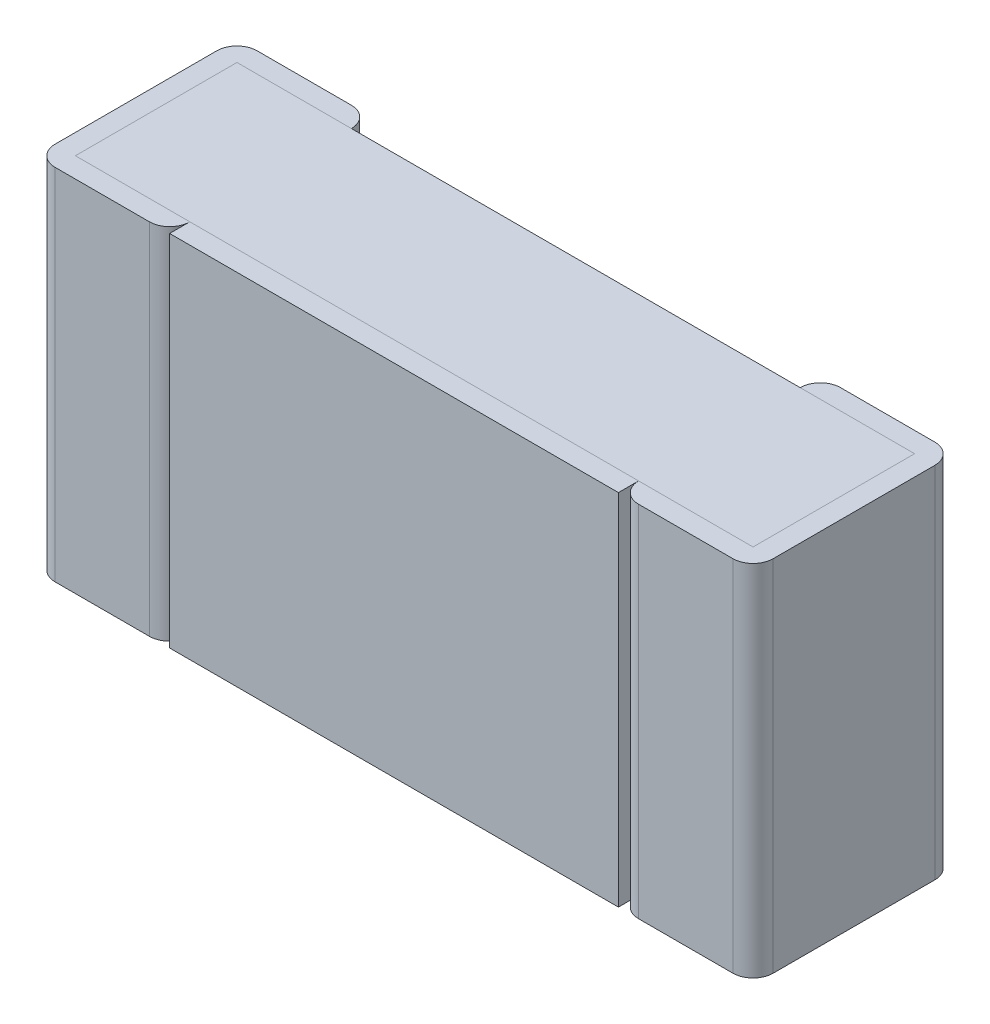
ISO-10303-21;
HEADER;
FILE_DESCRIPTION(('STEP AP214'),'2;1');
FILE_NAME('part.step','',(''),(''),'','','');
FILE_SCHEMA(('AUTOMOTIVE_DESIGN { 1 0 10303 214 1 1 1 1 }'));
ENDSEC;
DATA;
#1=APPLICATION_CONTEXT('core data for automotive mechanical design processes');
#2=APPLICATION_PROTOCOL_DEFINITION('international standard','automotive_design',2000,#1);
#3=PRODUCT_CONTEXT('',#1,'mechanical');
#4=PRODUCT('Part','Part','',(#3));
#5=PRODUCT_RELATED_PRODUCT_CATEGORY('part','',(#4));
#6=PRODUCT_DEFINITION_FORMATION('','',#4);
#7=PRODUCT_DEFINITION_CONTEXT('part definition',#1,'design');
#8=PRODUCT_DEFINITION('design','',#6,#7);
#9=PRODUCT_DEFINITION_SHAPE('','',#8);
#10=(LENGTH_UNIT() NAMED_UNIT(*) SI_UNIT(.MILLI.,.METRE.));
#11=(NAMED_UNIT(*) PLANE_ANGLE_UNIT() SI_UNIT($,.RADIAN.));
#12=(NAMED_UNIT(*) SI_UNIT($,.STERADIAN.) SOLID_ANGLE_UNIT());
#13=UNCERTAINTY_MEASURE_WITH_UNIT(LENGTH_MEASURE(1.E-05),#10,'distance_accuracy_value','');
#14=(GEOMETRIC_REPRESENTATION_CONTEXT(3) GLOBAL_UNCERTAINTY_ASSIGNED_CONTEXT((#13)) GLOBAL_UNIT_ASSIGNED_CONTEXT((#10,
#11,#12)) REPRESENTATION_CONTEXT('',''));
#15=CARTESIAN_POINT('',(0.,0.,0.));
#16=DIRECTION('',(0.,0.,1.));
#17=DIRECTION('',(1.,0.,0.));
#18=AXIS2_PLACEMENT_3D('',#15,#16,#17);
#19=CARTESIAN_POINT('',(-0.5,-0.4,0.45));
#20=DIRECTION('',(0.,0.,1.));
#21=DIRECTION('',(1.,0.,0.));
#22=AXIS2_PLACEMENT_3D('',#19,#20,#21);
#23=PLANE('',#22);
#24=DIRECTION('',(0.,1.,0.));
#25=VECTOR('',#24,1.);
#26=CARTESIAN_POINT('',(-0.5,-0.4,0.45));
#27=LINE('',#26,#25);
#28=CARTESIAN_POINT('',(-0.5,-0.4,0.45));
#29=VERTEX_POINT('',#28);
#30=CARTESIAN_POINT('',(-0.5,0.4,0.45));
#31=VERTEX_POINT('',#30);
#32=EDGE_CURVE('E411',#29,#31,#27,.T.);
#33=ORIENTED_EDGE('',*,*,#32,.F.);
#34=DIRECTION('',(1.,0.,0.));
#35=VECTOR('',#34,1.);
#36=CARTESIAN_POINT('',(-0.5,-0.4,0.45));
#37=LINE('',#36,#35);
#38=CARTESIAN_POINT('',(0.5,-0.4,0.45));
#39=VERTEX_POINT('',#38);
#40=EDGE_CURVE('E412',#29,#39,#37,.T.);
#41=ORIENTED_EDGE('',*,*,#40,.T.);
#42=DIRECTION('',(0.,1.,0.));
#43=VECTOR('',#42,1.);
#44=CARTESIAN_POINT('',(0.5,-0.4,0.45));
#45=LINE('',#44,#43);
#46=CARTESIAN_POINT('',(0.5,0.4,0.45));
#47=VERTEX_POINT('',#46);
#48=EDGE_CURVE('E11',#39,#47,#45,.T.);
#49=ORIENTED_EDGE('',*,*,#48,.T.);
#50=DIRECTION('',(1.,0.,0.));
#51=VECTOR('',#50,1.);
#52=CARTESIAN_POINT('',(-0.5,0.4,0.45));
#53=LINE('',#52,#51);
#54=EDGE_CURVE('E333',#31,#47,#53,.T.);
#55=ORIENTED_EDGE('',*,*,#54,.F.);
#56=EDGE_LOOP('',(#33,#41,#49,#55));
#57=FACE_BOUND('',#56,.T.);
#58=ADVANCED_FACE('F17',(#57),#23,.T.);
#59=CARTESIAN_POINT('',(0.5,-0.4,0.405));
#60=DIRECTION('',(1.,0.,0.));
#61=DIRECTION('',(0.,1.,0.));
#62=AXIS2_PLACEMENT_3D('',#59,#60,#61);
#63=PLANE('',#62);
#64=DIRECTION('',(0.,0.,1.));
#65=VECTOR('',#64,1.);
#66=CARTESIAN_POINT('',(0.5,-0.4,0.405));
#67=LINE('',#66,#65);
#68=CARTESIAN_POINT('',(0.5,-0.4,0.405));
#69=VERTEX_POINT('',#68);
#70=EDGE_CURVE('E418',#69,#39,#67,.T.);
#71=ORIENTED_EDGE('',*,*,#70,.F.);
#72=DIRECTION('',(0.,1.,0.));
#73=VECTOR('',#72,1.);
#74=CARTESIAN_POINT('',(0.5,-0.4,0.405));
#75=LINE('',#74,#73);
#76=CARTESIAN_POINT('',(0.5,0.4,0.405));
#77=VERTEX_POINT('',#76);
#78=EDGE_CURVE('E28',#69,#77,#75,.T.);
#79=ORIENTED_EDGE('',*,*,#78,.T.);
#80=DIRECTION('',(0.,0.,1.));
#81=VECTOR('',#80,1.);
#82=CARTESIAN_POINT('',(0.5,0.4,0.405));
#83=LINE('',#82,#81);
#84=EDGE_CURVE('E330',#77,#47,#83,.T.);
#85=ORIENTED_EDGE('',*,*,#84,.T.);
#86=ORIENTED_EDGE('',*,*,#48,.F.);
#87=EDGE_LOOP('',(#71,#79,#85,#86));
#88=FACE_BOUND('',#87,.T.);
#89=ADVANCED_FACE('F602',(#88),#63,.T.);
#90=CARTESIAN_POINT('',(0.545,-0.4,0.405));
#91=DIRECTION('',(0.,1.,0.));
#92=DIRECTION('',(-1.,0.,0.));
#93=AXIS2_PLACEMENT_3D('',#90,#91,#92);
#94=CYLINDRICAL_SURFACE('',#93,0.045);
#95=CARTESIAN_POINT('',(0.545,-0.4,0.405));
#96=DIRECTION('',(0.,1.,0.));
#97=DIRECTION('',(0.,0.,1.));
#98=AXIS2_PLACEMENT_3D('',#95,#96,#97);
#99=CIRCLE('',#98,0.045);
#100=CARTESIAN_POINT('',(0.545,-0.4,0.45));
#101=VERTEX_POINT('',#100);
#102=EDGE_CURVE('E322',#69,#101,#99,.T.);
#103=ORIENTED_EDGE('',*,*,#102,.T.);
#104=DIRECTION('',(0.,1.,0.));
#105=VECTOR('',#104,1.);
#106=CARTESIAN_POINT('',(0.545,-0.4,0.45));
#107=LINE('',#106,#105);
#108=CARTESIAN_POINT('',(0.545,0.4,0.45));
#109=VERTEX_POINT('',#108);
#110=EDGE_CURVE('E193',#101,#109,#107,.T.);
#111=ORIENTED_EDGE('',*,*,#110,.T.);
#112=CARTESIAN_POINT('',(0.545,0.4,0.405));
#113=DIRECTION('',(0.,1.,0.));
#114=DIRECTION('',(0.,0.,1.));
#115=AXIS2_PLACEMENT_3D('',#112,#113,#114);
#116=CIRCLE('',#115,0.045);
#117=EDGE_CURVE('E323',#77,#109,#116,.T.);
#118=ORIENTED_EDGE('',*,*,#117,.F.);
#119=ORIENTED_EDGE('',*,*,#78,.F.);
#120=EDGE_LOOP('',(#103,#111,#118,#119));
#121=FACE_BOUND('',#120,.T.);
#122=ADVANCED_FACE('F606',(#121),#94,.T.);
#123=CARTESIAN_POINT('',(0.5,-0.4,0.45));
#124=DIRECTION('',(0.,0.,1.));
#125=DIRECTION('',(1.,0.,0.));
#126=AXIS2_PLACEMENT_3D('',#123,#124,#125);
#127=PLANE('',#126);
#128=DIRECTION('',(1.,0.,0.));
#129=VECTOR('',#128,1.);
#130=CARTESIAN_POINT('',(0.5,0.4,0.45));
#131=LINE('',#130,#129);
#132=CARTESIAN_POINT('',(0.755,0.4,0.45));
#133=VERTEX_POINT('',#132);
#134=EDGE_CURVE('E327',#109,#133,#131,.T.);
#135=ORIENTED_EDGE('',*,*,#134,.F.);
#136=ORIENTED_EDGE('',*,*,#110,.F.);
#137=DIRECTION('',(1.,0.,0.));
#138=VECTOR('',#137,1.);
#139=CARTESIAN_POINT('',(0.5,-0.4,0.45));
#140=LINE('',#139,#138);
#141=CARTESIAN_POINT('',(0.755,-0.4,0.45));
#142=VERTEX_POINT('',#141);
#143=EDGE_CURVE('E363',#101,#142,#140,.T.);
#144=ORIENTED_EDGE('',*,*,#143,.T.);
#145=DIRECTION('',(0.,1.,0.));
#146=VECTOR('',#145,1.);
#147=CARTESIAN_POINT('',(0.755,-0.4,0.45));
#148=LINE('',#147,#146);
#149=EDGE_CURVE('E297',#142,#133,#148,.T.);
#150=ORIENTED_EDGE('',*,*,#149,.T.);
#151=EDGE_LOOP('',(#135,#136,#144,#150));
#152=FACE_BOUND('',#151,.T.);
#153=ADVANCED_FACE('F462',(#152),#127,.T.);
#154=CARTESIAN_POINT('',(0.755,-0.4,0.405));
#155=DIRECTION('',(0.,1.,0.));
#156=DIRECTION('',(1.,0.,0.));
#157=AXIS2_PLACEMENT_3D('',#154,#155,#156);
#158=CYLINDRICAL_SURFACE('',#157,0.045);
#159=DIRECTION('',(0.,1.,0.));
#160=VECTOR('',#159,1.);
#161=CARTESIAN_POINT('',(0.8,-0.4,0.405));
#162=LINE('',#161,#160);
#163=CARTESIAN_POINT('',(0.8,-0.4,0.405));
#164=VERTEX_POINT('',#163);
#165=CARTESIAN_POINT('',(0.8,0.4,0.405));
#166=VERTEX_POINT('',#165);
#167=EDGE_CURVE('E300',#164,#166,#162,.T.);
#168=ORIENTED_EDGE('',*,*,#167,.T.);
#169=CARTESIAN_POINT('',(0.755,0.4,0.405));
#170=DIRECTION('',(0.,-1.,0.));
#171=DIRECTION('',(0.,0.,1.));
#172=AXIS2_PLACEMENT_3D('',#169,#170,#171);
#173=CIRCLE('',#172,0.045);
#174=EDGE_CURVE('E276',#166,#133,#173,.T.);
#175=ORIENTED_EDGE('',*,*,#174,.T.);
#176=ORIENTED_EDGE('',*,*,#149,.F.);
#177=CARTESIAN_POINT('',(0.755,-0.4,0.405));
#178=DIRECTION('',(0.,-1.,0.));
#179=DIRECTION('',(0.,0.,1.));
#180=AXIS2_PLACEMENT_3D('',#177,#178,#179);
#181=CIRCLE('',#180,0.045);
#182=EDGE_CURVE('E442',#164,#142,#181,.T.);
#183=ORIENTED_EDGE('',*,*,#182,.F.);
#184=EDGE_LOOP('',(#168,#175,#176,#183));
#185=FACE_BOUND('',#184,.T.);
#186=ADVANCED_FACE('F467',(#185),#158,.T.);
#187=CARTESIAN_POINT('',(0.8,-0.4,0.));
#188=DIRECTION('',(1.,0.,0.));
#189=DIRECTION('',(0.,1.,0.));
#190=AXIS2_PLACEMENT_3D('',#187,#188,#189);
#191=PLANE('',#190);
#192=DIRECTION('',(0.,0.,1.));
#193=VECTOR('',#192,1.);
#194=CARTESIAN_POINT('',(0.8,-0.4,0.));
#195=LINE('',#194,#193);
#196=CARTESIAN_POINT('',(0.8,-0.4,0.045));
#197=VERTEX_POINT('',#196);
#198=EDGE_CURVE('E446',#197,#164,#195,.T.);
#199=ORIENTED_EDGE('',*,*,#198,.F.);
#200=DIRECTION('',(0.,1.,0.));
#201=VECTOR('',#200,1.);
#202=CARTESIAN_POINT('',(0.8,-0.4,0.045));
#203=LINE('',#202,#201);
#204=CARTESIAN_POINT('',(0.8,0.4,0.045));
#205=VERTEX_POINT('',#204);
#206=EDGE_CURVE('E303',#197,#205,#203,.T.);
#207=ORIENTED_EDGE('',*,*,#206,.T.);
#208=DIRECTION('',(0.,0.,1.));
#209=VECTOR('',#208,1.);
#210=CARTESIAN_POINT('',(0.8,0.4,0.));
#211=LINE('',#210,#209);
#212=EDGE_CURVE('E271',#205,#166,#211,.T.);
#213=ORIENTED_EDGE('',*,*,#212,.T.);
#214=ORIENTED_EDGE('',*,*,#167,.F.);
#215=EDGE_LOOP('',(#199,#207,#213,#214));
#216=FACE_BOUND('',#215,.T.);
#217=ADVANCED_FACE('F475',(#216),#191,.T.);
#218=CARTESIAN_POINT('',(0.755,-0.4,0.045));
#219=DIRECTION('',(0.,1.,0.));
#220=DIRECTION('',(1.,0.,0.));
#221=AXIS2_PLACEMENT_3D('',#218,#219,#220);
#222=CYLINDRICAL_SURFACE('',#221,0.045);
#223=CARTESIAN_POINT('',(0.755,-0.4,0.045));
#224=DIRECTION('',(0.,1.,0.));
#225=DIRECTION('',(0.,0.,1.));
#226=AXIS2_PLACEMENT_3D('',#223,#224,#225);
#227=CIRCLE('',#226,0.045);
#228=CARTESIAN_POINT('',(0.755,-0.4,0.));
#229=VERTEX_POINT('',#228);
#230=EDGE_CURVE('E406',#197,#229,#227,.T.);
#231=ORIENTED_EDGE('',*,*,#230,.T.);
#232=DIRECTION('',(0.,1.,0.));
#233=VECTOR('',#232,1.);
#234=CARTESIAN_POINT('',(0.755,-0.4,0.));
#235=LINE('',#234,#233);
#236=CARTESIAN_POINT('',(0.755,0.4,0.));
#237=VERTEX_POINT('',#236);
#238=EDGE_CURVE('E181',#229,#237,#235,.T.);
#239=ORIENTED_EDGE('',*,*,#238,.T.);
#240=CARTESIAN_POINT('',(0.755,0.4,0.045));
#241=DIRECTION('',(0.,1.,0.));
#242=DIRECTION('',(0.,0.,1.));
#243=AXIS2_PLACEMENT_3D('',#240,#241,#242);
#244=CIRCLE('',#243,0.045);
#245=EDGE_CURVE('E275',#205,#237,#244,.T.);
#246=ORIENTED_EDGE('',*,*,#245,.F.);
#247=ORIENTED_EDGE('',*,*,#206,.F.);
#248=EDGE_LOOP('',(#231,#239,#246,#247));
#249=FACE_BOUND('',#248,.T.);
#250=ADVANCED_FACE('F481',(#249),#222,.T.);
#251=CARTESIAN_POINT('',(0.5,-0.4,0.));
#252=DIRECTION('',(0.,0.,1.));
#253=DIRECTION('',(1.,0.,0.));
#254=AXIS2_PLACEMENT_3D('',#251,#252,#253);
#255=PLANE('',#254);
#256=ORIENTED_EDGE('',*,*,#238,.F.);
#257=DIRECTION('',(1.,0.,0.));
#258=VECTOR('',#257,1.);
#259=CARTESIAN_POINT('',(0.5,-0.4,0.));
#260=LINE('',#259,#258);
#261=CARTESIAN_POINT('',(0.545,-0.4,0.));
#262=VERTEX_POINT('',#261);
#263=EDGE_CURVE('E321',#262,#229,#260,.T.);
#264=ORIENTED_EDGE('',*,*,#263,.F.);
#265=DIRECTION('',(0.,1.,0.));
#266=VECTOR('',#265,1.);
#267=CARTESIAN_POINT('',(0.545,-0.4,0.));
#268=LINE('',#267,#266);
#269=CARTESIAN_POINT('',(0.545,0.4,0.));
#270=VERTEX_POINT('',#269);
#271=EDGE_CURVE('E172',#262,#270,#268,.T.);
#272=ORIENTED_EDGE('',*,*,#271,.T.);
#273=DIRECTION('',(1.,0.,0.));
#274=VECTOR('',#273,1.);
#275=CARTESIAN_POINT('',(0.5,0.4,0.));
#276=LINE('',#275,#274);
#277=EDGE_CURVE('E281',#270,#237,#276,.T.);
#278=ORIENTED_EDGE('',*,*,#277,.T.);
#279=EDGE_LOOP('',(#256,#264,#272,#278));
#280=FACE_BOUND('',#279,.T.);
#281=ADVANCED_FACE('F478',(#280),#255,.F.);
#282=CARTESIAN_POINT('',(0.545,-0.4,0.045));
#283=DIRECTION('',(0.,1.,0.));
#284=DIRECTION('',(-1.,0.,0.));
#285=AXIS2_PLACEMENT_3D('',#282,#283,#284);
#286=CYLINDRICAL_SURFACE('',#285,0.045);
#287=DIRECTION('',(0.,1.,0.));
#288=VECTOR('',#287,1.);
#289=CARTESIAN_POINT('',(0.5,-0.4,0.045));
#290=LINE('',#289,#288);
#291=CARTESIAN_POINT('',(0.5,-0.4,0.045));
#292=VERTEX_POINT('',#291);
#293=CARTESIAN_POINT('',(0.5,0.4,0.045));
#294=VERTEX_POINT('',#293);
#295=EDGE_CURVE('E353',#292,#294,#290,.T.);
#296=ORIENTED_EDGE('',*,*,#295,.T.);
#297=CARTESIAN_POINT('',(0.545,0.4,0.045));
#298=DIRECTION('',(0.,-1.,0.));
#299=DIRECTION('',(0.,0.,1.));
#300=AXIS2_PLACEMENT_3D('',#297,#298,#299);
#301=CIRCLE('',#300,0.045);
#302=EDGE_CURVE('E284',#294,#270,#301,.T.);
#303=ORIENTED_EDGE('',*,*,#302,.T.);
#304=ORIENTED_EDGE('',*,*,#271,.F.);
#305=CARTESIAN_POINT('',(0.545,-0.4,0.045));
#306=DIRECTION('',(0.,-1.,0.));
#307=DIRECTION('',(0.,0.,1.));
#308=AXIS2_PLACEMENT_3D('',#305,#306,#307);
#309=CIRCLE('',#308,0.045);
#310=EDGE_CURVE('E317',#292,#262,#309,.T.);
#311=ORIENTED_EDGE('',*,*,#310,.F.);
#312=EDGE_LOOP('',(#296,#303,#304,#311));
#313=FACE_BOUND('',#312,.T.);
#314=ADVANCED_FACE('F651',(#313),#286,.T.);
#315=CARTESIAN_POINT('',(-0.5,0.4,0.405));
#316=DIRECTION('',(0.,1.,0.));
#317=DIRECTION('',(1.,0.,0.));
#318=AXIS2_PLACEMENT_3D('',#315,#316,#317);
#319=PLANE('',#318);
#320=DIRECTION('',(1.,0.,0.));
#321=VECTOR('',#320,1.);
#322=CARTESIAN_POINT('',(-0.5,0.4,0.405));
#323=LINE('',#322,#321);
#324=CARTESIAN_POINT('',(-0.5,0.4,0.405));
#325=VERTEX_POINT('',#324);
#326=EDGE_CURVE('E296',#325,#77,#323,.T.);
#327=ORIENTED_EDGE('',*,*,#326,.F.);
#328=DIRECTION('',(0.,0.,1.));
#329=VECTOR('',#328,1.);
#330=CARTESIAN_POINT('',(-0.5,0.4,0.405));
#331=LINE('',#330,#329);
#332=EDGE_CURVE('E285',#325,#31,#331,.T.);
#333=ORIENTED_EDGE('',*,*,#332,.T.);
#334=ORIENTED_EDGE('',*,*,#54,.T.);
#335=ORIENTED_EDGE('',*,*,#84,.F.);
#336=EDGE_LOOP('',(#327,#333,#334,#335));
#337=FACE_BOUND('',#336,.T.);
#338=ADVANCED_FACE('F563',(#337),#319,.T.);
#339=CARTESIAN_POINT('',(0.5,0.4,0.));
#340=DIRECTION('',(0.,1.,0.));
#341=DIRECTION('',(1.,0.,0.));
#342=AXIS2_PLACEMENT_3D('',#339,#340,#341);
#343=PLANE('',#342);
#344=ORIENTED_EDGE('',*,*,#277,.F.);
#345=ORIENTED_EDGE('',*,*,#302,.F.);
#346=DIRECTION('',(1.,0.,0.));
#347=VECTOR('',#346,1.);
#348=CARTESIAN_POINT('',(-0.755,0.4,0.045));
#349=LINE('',#348,#347);
#350=CARTESIAN_POINT('',(0.755,0.4,0.045));
#351=VERTEX_POINT('',#350);
#352=EDGE_CURVE('E348',#294,#351,#349,.T.);
#353=ORIENTED_EDGE('',*,*,#352,.T.);
#354=DIRECTION('',(0.,0.,1.));
#355=VECTOR('',#354,1.);
#356=CARTESIAN_POINT('',(0.755,0.4,0.045));
#357=LINE('',#356,#355);
#358=CARTESIAN_POINT('',(0.755,0.4,0.405));
#359=VERTEX_POINT('',#358);
#360=EDGE_CURVE('E295',#351,#359,#357,.T.);
#361=ORIENTED_EDGE('',*,*,#360,.T.);
#362=DIRECTION('',(1.,0.,0.));
#363=VECTOR('',#362,1.);
#364=CARTESIAN_POINT('',(-0.755,0.4,0.405));
#365=LINE('',#364,#363);
#366=EDGE_CURVE('E291',#77,#359,#365,.T.);
#367=ORIENTED_EDGE('',*,*,#366,.F.);
#368=ORIENTED_EDGE('',*,*,#117,.T.);
#369=ORIENTED_EDGE('',*,*,#134,.T.);
#370=ORIENTED_EDGE('',*,*,#174,.F.);
#371=ORIENTED_EDGE('',*,*,#212,.F.);
#372=ORIENTED_EDGE('',*,*,#245,.T.);
#373=EDGE_LOOP('',(#344,#345,#353,#361,#367,#368,#369,#370,#371,#372));
#374=FACE_BOUND('',#373,.T.);
#375=ADVANCED_FACE('F458',(#374),#343,.T.);
#376=CARTESIAN_POINT('',(-0.5,-0.4,0.405));
#377=DIRECTION('',(1.,0.,0.));
#378=DIRECTION('',(0.,1.,0.));
#379=AXIS2_PLACEMENT_3D('',#376,#377,#378);
#380=PLANE('',#379);
#381=ORIENTED_EDGE('',*,*,#32,.T.);
#382=ORIENTED_EDGE('',*,*,#332,.F.);
#383=DIRECTION('',(0.,1.,0.));
#384=VECTOR('',#383,1.);
#385=CARTESIAN_POINT('',(-0.5,-0.4,0.405));
#386=LINE('',#385,#384);
#387=CARTESIAN_POINT('',(-0.5,-0.4,0.405));
#388=VERTEX_POINT('',#387);
#389=EDGE_CURVE('E392',#388,#325,#386,.T.);
#390=ORIENTED_EDGE('',*,*,#389,.F.);
#391=DIRECTION('',(0.,0.,1.));
#392=VECTOR('',#391,1.);
#393=CARTESIAN_POINT('',(-0.5,-0.4,0.405));
#394=LINE('',#393,#392);
#395=EDGE_CURVE('E407',#388,#29,#394,.T.);
#396=ORIENTED_EDGE('',*,*,#395,.T.);
#397=EDGE_LOOP('',(#381,#382,#390,#396));
#398=FACE_BOUND('',#397,.T.);
#399=ADVANCED_FACE('F19',(#398),#380,.F.);
#400=CARTESIAN_POINT('',(-0.5,-0.4,0.405));
#401=DIRECTION('',(0.,1.,0.));
#402=DIRECTION('',(1.,0.,0.));
#403=AXIS2_PLACEMENT_3D('',#400,#401,#402);
#404=PLANE('',#403);
#405=ORIENTED_EDGE('',*,*,#70,.T.);
#406=ORIENTED_EDGE('',*,*,#40,.F.);
#407=ORIENTED_EDGE('',*,*,#395,.F.);
#408=DIRECTION('',(1.,0.,0.));
#409=VECTOR('',#408,1.);
#410=CARTESIAN_POINT('',(-0.5,-0.4,0.405));
#411=LINE('',#410,#409);
#412=EDGE_CURVE('E238',#388,#69,#411,.T.);
#413=ORIENTED_EDGE('',*,*,#412,.T.);
#414=EDGE_LOOP('',(#405,#406,#407,#413));
#415=FACE_BOUND('',#414,.T.);
#416=ADVANCED_FACE('F545',(#415),#404,.F.);
#417=CARTESIAN_POINT('',(0.5,-0.4,0.));
#418=DIRECTION('',(0.,1.,0.));
#419=DIRECTION('',(1.,0.,0.));
#420=AXIS2_PLACEMENT_3D('',#417,#418,#419);
#421=PLANE('',#420);
#422=ORIENTED_EDGE('',*,*,#230,.F.);
#423=ORIENTED_EDGE('',*,*,#198,.T.);
#424=ORIENTED_EDGE('',*,*,#182,.T.);
#425=ORIENTED_EDGE('',*,*,#143,.F.);
#426=ORIENTED_EDGE('',*,*,#102,.F.);
#427=DIRECTION('',(1.,0.,0.));
#428=VECTOR('',#427,1.);
#429=CARTESIAN_POINT('',(-0.755,-0.4,0.405));
#430=LINE('',#429,#428);
#431=CARTESIAN_POINT('',(0.755,-0.4,0.405));
#432=VERTEX_POINT('',#431);
#433=EDGE_CURVE('E97',#69,#432,#430,.T.);
#434=ORIENTED_EDGE('',*,*,#433,.T.);
#435=DIRECTION('',(0.,0.,1.));
#436=VECTOR('',#435,1.);
#437=CARTESIAN_POINT('',(0.755,-0.4,0.045));
#438=LINE('',#437,#436);
#439=CARTESIAN_POINT('',(0.755,-0.4,0.045));
#440=VERTEX_POINT('',#439);
#441=EDGE_CURVE('E109',#440,#432,#438,.T.);
#442=ORIENTED_EDGE('',*,*,#441,.F.);
#443=DIRECTION('',(1.,0.,0.));
#444=VECTOR('',#443,1.);
#445=CARTESIAN_POINT('',(-0.755,-0.4,0.045));
#446=LINE('',#445,#444);
#447=EDGE_CURVE('E316',#292,#440,#446,.T.);
#448=ORIENTED_EDGE('',*,*,#447,.F.);
#449=ORIENTED_EDGE('',*,*,#310,.T.);
#450=ORIENTED_EDGE('',*,*,#263,.T.);
#451=EDGE_LOOP('',(#422,#423,#424,#425,#426,#434,#442,#448,#449,#450));
#452=FACE_BOUND('',#451,.T.);
#453=ADVANCED_FACE('F480',(#452),#421,.F.);
#454=CARTESIAN_POINT('',(-0.755,-0.4,0.045));
#455=DIRECTION('',(0.,0.,1.));
#456=DIRECTION('',(1.,0.,0.));
#457=AXIS2_PLACEMENT_3D('',#454,#455,#456);
#458=PLANE('',#457);
#459=DIRECTION('',(1.,0.,0.));
#460=VECTOR('',#459,1.);
#461=CARTESIAN_POINT('',(-0.755,0.4,0.045));
#462=LINE('',#461,#460);
#463=CARTESIAN_POINT('',(-0.5,0.4,0.045));
#464=VERTEX_POINT('',#463);
#465=EDGE_CURVE('E349',#464,#294,#462,.T.);
#466=ORIENTED_EDGE('',*,*,#465,.T.);
#467=ORIENTED_EDGE('',*,*,#295,.F.);
#468=DIRECTION('',(1.,0.,0.));
#469=VECTOR('',#468,1.);
#470=CARTESIAN_POINT('',(-0.755,-0.4,0.045));
#471=LINE('',#470,#469);
#472=CARTESIAN_POINT('',(-0.5,-0.4,0.045));
#473=VERTEX_POINT('',#472);
#474=EDGE_CURVE('E269',#473,#292,#471,.T.);
#475=ORIENTED_EDGE('',*,*,#474,.F.);
#476=DIRECTION('',(0.,1.,0.));
#477=VECTOR('',#476,1.);
#478=CARTESIAN_POINT('',(-0.5,-0.4,0.045));
#479=LINE('',#478,#477);
#480=EDGE_CURVE('E266',#473,#464,#479,.T.);
#481=ORIENTED_EDGE('',*,*,#480,.T.);
#482=EDGE_LOOP('',(#466,#467,#475,#481));
#483=FACE_BOUND('',#482,.T.);
#484=ADVANCED_FACE('F572',(#483),#458,.F.);
#485=CARTESIAN_POINT('',(-0.755,0.4,0.045));
#486=DIRECTION('',(0.,1.,0.));
#487=DIRECTION('',(1.,0.,0.));
#488=AXIS2_PLACEMENT_3D('',#485,#486,#487);
#489=PLANE('',#488);
#490=DIRECTION('',(1.,0.,0.));
#491=VECTOR('',#490,1.);
#492=CARTESIAN_POINT('',(-0.755,0.4,0.045));
#493=LINE('',#492,#491);
#494=CARTESIAN_POINT('',(-0.755,0.4,0.045));
#495=VERTEX_POINT('',#494);
#496=EDGE_CURVE('E423',#495,#464,#493,.T.);
#497=ORIENTED_EDGE('',*,*,#496,.F.);
#498=DIRECTION('',(0.,0.,1.));
#499=VECTOR('',#498,1.);
#500=CARTESIAN_POINT('',(-0.755,0.4,0.045));
#501=LINE('',#500,#499);
#502=CARTESIAN_POINT('',(-0.755,0.4,0.405));
#503=VERTEX_POINT('',#502);
#504=EDGE_CURVE('E382',#495,#503,#501,.T.);
#505=ORIENTED_EDGE('',*,*,#504,.T.);
#506=DIRECTION('',(1.,0.,0.));
#507=VECTOR('',#506,1.);
#508=CARTESIAN_POINT('',(-0.755,0.4,0.405));
#509=LINE('',#508,#507);
#510=EDGE_CURVE('E378',#503,#325,#509,.T.);
#511=ORIENTED_EDGE('',*,*,#510,.T.);
#512=ORIENTED_EDGE('',*,*,#326,.T.);
#513=ORIENTED_EDGE('',*,*,#366,.T.);
#514=ORIENTED_EDGE('',*,*,#360,.F.);
#515=ORIENTED_EDGE('',*,*,#352,.F.);
#516=ORIENTED_EDGE('',*,*,#465,.F.);
#517=EDGE_LOOP('',(#497,#505,#511,#512,#513,#514,#515,#516));
#518=FACE_BOUND('',#517,.T.);
#519=ADVANCED_FACE('F666',(#518),#489,.T.);
#520=CARTESIAN_POINT('',(-0.8,-0.4,0.45));
#521=DIRECTION('',(0.,0.,1.));
#522=DIRECTION('',(1.,0.,0.));
#523=AXIS2_PLACEMENT_3D('',#520,#521,#522);
#524=PLANE('',#523);
#525=DIRECTION('',(1.,0.,0.));
#526=VECTOR('',#525,1.);
#527=CARTESIAN_POINT('',(-0.8,0.4,0.45));
#528=LINE('',#527,#526);
#529=CARTESIAN_POINT('',(-0.755,0.4,0.45));
#530=VERTEX_POINT('',#529);
#531=CARTESIAN_POINT('',(-0.545,0.4,0.45));
#532=VERTEX_POINT('',#531);
#533=EDGE_CURVE('E308',#530,#532,#528,.T.);
#534=ORIENTED_EDGE('',*,*,#533,.F.);
#535=DIRECTION('',(0.,1.,0.));
#536=VECTOR('',#535,1.);
#537=CARTESIAN_POINT('',(-0.755,-0.4,0.45));
#538=LINE('',#537,#536);
#539=CARTESIAN_POINT('',(-0.755,-0.4,0.45));
#540=VERTEX_POINT('',#539);
#541=EDGE_CURVE('E377',#540,#530,#538,.T.);
#542=ORIENTED_EDGE('',*,*,#541,.F.);
#543=DIRECTION('',(1.,0.,0.));
#544=VECTOR('',#543,1.);
#545=CARTESIAN_POINT('',(-0.8,-0.4,0.45));
#546=LINE('',#545,#544);
#547=CARTESIAN_POINT('',(-0.545,-0.4,0.45));
#548=VERTEX_POINT('',#547);
#549=EDGE_CURVE('E286',#540,#548,#546,.T.);
#550=ORIENTED_EDGE('',*,*,#549,.T.);
#551=DIRECTION('',(0.,1.,0.));
#552=VECTOR('',#551,1.);
#553=CARTESIAN_POINT('',(-0.545,-0.4,0.45));
#554=LINE('',#553,#552);
#555=EDGE_CURVE('E264',#548,#532,#554,.T.);
#556=ORIENTED_EDGE('',*,*,#555,.T.);
#557=EDGE_LOOP('',(#534,#542,#550,#556));
#558=FACE_BOUND('',#557,.T.);
#559=ADVANCED_FACE('F514',(#558),#524,.T.);
#560=CARTESIAN_POINT('',(-0.545,-0.4,0.405));
#561=DIRECTION('',(0.,1.,0.));
#562=DIRECTION('',(1.,0.,0.));
#563=AXIS2_PLACEMENT_3D('',#560,#561,#562);
#564=CYLINDRICAL_SURFACE('',#563,0.045);
#565=ORIENTED_EDGE('',*,*,#389,.T.);
#566=CARTESIAN_POINT('',(-0.545,0.4,0.405));
#567=DIRECTION('',(0.,-1.,0.));
#568=DIRECTION('',(0.,0.,1.));
#569=AXIS2_PLACEMENT_3D('',#566,#567,#568);
#570=CIRCLE('',#569,0.045);
#571=EDGE_CURVE('E383',#325,#532,#570,.T.);
#572=ORIENTED_EDGE('',*,*,#571,.T.);
#573=ORIENTED_EDGE('',*,*,#555,.F.);
#574=CARTESIAN_POINT('',(-0.545,-0.4,0.405));
#575=DIRECTION('',(0.,-1.,0.));
#576=DIRECTION('',(0.,0.,1.));
#577=AXIS2_PLACEMENT_3D('',#574,#575,#576);
#578=CIRCLE('',#577,0.045);
#579=EDGE_CURVE('E243',#388,#548,#578,.T.);
#580=ORIENTED_EDGE('',*,*,#579,.F.);
#581=EDGE_LOOP('',(#565,#572,#573,#580));
#582=FACE_BOUND('',#581,.T.);
#583=ADVANCED_FACE('F509',(#582),#564,.T.);
#584=CARTESIAN_POINT('',(-0.755,-0.4,0.045));
#585=DIRECTION('',(0.,1.,0.));
#586=DIRECTION('',(1.,0.,0.));
#587=AXIS2_PLACEMENT_3D('',#584,#585,#586);
#588=PLANE('',#587);
#589=ORIENTED_EDGE('',*,*,#474,.T.);
#590=ORIENTED_EDGE('',*,*,#447,.T.);
#591=ORIENTED_EDGE('',*,*,#441,.T.);
#592=ORIENTED_EDGE('',*,*,#433,.F.);
#593=ORIENTED_EDGE('',*,*,#412,.F.);
#594=DIRECTION('',(1.,0.,0.));
#595=VECTOR('',#594,1.);
#596=CARTESIAN_POINT('',(-0.755,-0.4,0.405));
#597=LINE('',#596,#595);
#598=CARTESIAN_POINT('',(-0.755,-0.4,0.405));
#599=VERTEX_POINT('',#598);
#600=EDGE_CURVE('E231',#599,#388,#597,.T.);
#601=ORIENTED_EDGE('',*,*,#600,.F.);
#602=DIRECTION('',(0.,0.,1.));
#603=VECTOR('',#602,1.);
#604=CARTESIAN_POINT('',(-0.755,-0.4,0.045));
#605=LINE('',#604,#603);
#606=CARTESIAN_POINT('',(-0.755,-0.4,0.045));
#607=VERTEX_POINT('',#606);
#608=EDGE_CURVE('E21',#607,#599,#605,.T.);
#609=ORIENTED_EDGE('',*,*,#608,.F.);
#610=DIRECTION('',(1.,0.,0.));
#611=VECTOR('',#610,1.);
#612=CARTESIAN_POINT('',(-0.755,-0.4,0.045));
#613=LINE('',#612,#611);
#614=EDGE_CURVE('E247',#607,#473,#613,.T.);
#615=ORIENTED_EDGE('',*,*,#614,.T.);
#616=EDGE_LOOP('',(#589,#590,#591,#592,#593,#601,#609,#615));
#617=FACE_BOUND('',#616,.T.);
#618=ADVANCED_FACE('F234',(#617),#588,.F.);
#619=CARTESIAN_POINT('',(-0.545,-0.4,0.045));
#620=DIRECTION('',(0.,1.,0.));
#621=DIRECTION('',(1.,0.,0.));
#622=AXIS2_PLACEMENT_3D('',#619,#620,#621);
#623=CYLINDRICAL_SURFACE('',#622,0.045);
#624=CARTESIAN_POINT('',(-0.545,-0.4,0.045));
#625=DIRECTION('',(0.,1.,0.));
#626=DIRECTION('',(0.,0.,1.));
#627=AXIS2_PLACEMENT_3D('',#624,#625,#626);
#628=CIRCLE('',#627,0.045);
#629=CARTESIAN_POINT('',(-0.545,-0.4,0.));
#630=VERTEX_POINT('',#629);
#631=EDGE_CURVE('E253',#473,#630,#628,.T.);
#632=ORIENTED_EDGE('',*,*,#631,.T.);
#633=DIRECTION('',(0.,1.,0.));
#634=VECTOR('',#633,1.);
#635=CARTESIAN_POINT('',(-0.545,-0.4,0.));
#636=LINE('',#635,#634);
#637=CARTESIAN_POINT('',(-0.545,0.4,0.));
#638=VERTEX_POINT('',#637);
#639=EDGE_CURVE('E270',#630,#638,#636,.T.);
#640=ORIENTED_EDGE('',*,*,#639,.T.);
#641=CARTESIAN_POINT('',(-0.545,0.4,0.045));
#642=DIRECTION('',(0.,1.,0.));
#643=DIRECTION('',(0.,0.,1.));
#644=AXIS2_PLACEMENT_3D('',#641,#642,#643);
#645=CIRCLE('',#644,0.045);
#646=EDGE_CURVE('E386',#464,#638,#645,.T.);
#647=ORIENTED_EDGE('',*,*,#646,.F.);
#648=ORIENTED_EDGE('',*,*,#480,.F.);
#649=EDGE_LOOP('',(#632,#640,#647,#648));
#650=FACE_BOUND('',#649,.T.);
#651=ADVANCED_FACE('F613',(#650),#623,.T.);
#652=CARTESIAN_POINT('',(-0.8,-0.4,0.));
#653=DIRECTION('',(0.,0.,1.));
#654=DIRECTION('',(1.,0.,0.));
#655=AXIS2_PLACEMENT_3D('',#652,#653,#654);
#656=PLANE('',#655);
#657=ORIENTED_EDGE('',*,*,#639,.F.);
#658=DIRECTION('',(1.,0.,0.));
#659=VECTOR('',#658,1.);
#660=CARTESIAN_POINT('',(-0.8,-0.4,0.));
#661=LINE('',#660,#659);
#662=CARTESIAN_POINT('',(-0.755,-0.4,0.));
#663=VERTEX_POINT('',#662);
#664=EDGE_CURVE('E391',#663,#630,#661,.T.);
#665=ORIENTED_EDGE('',*,*,#664,.F.);
#666=DIRECTION('',(0.,1.,0.));
#667=VECTOR('',#666,1.);
#668=CARTESIAN_POINT('',(-0.755,-0.4,0.));
#669=LINE('',#668,#667);
#670=CARTESIAN_POINT('',(-0.755,0.4,0.));
#671=VERTEX_POINT('',#670);
#672=EDGE_CURVE('E493',#663,#671,#669,.T.);
#673=ORIENTED_EDGE('',*,*,#672,.T.);
#674=DIRECTION('',(1.,0.,0.));
#675=VECTOR('',#674,1.);
#676=CARTESIAN_POINT('',(-0.8,0.4,0.));
#677=LINE('',#676,#675);
#678=EDGE_CURVE('E304',#671,#638,#677,.T.);
#679=ORIENTED_EDGE('',*,*,#678,.T.);
#680=EDGE_LOOP('',(#657,#665,#673,#679));
#681=FACE_BOUND('',#680,.T.);
#682=ADVANCED_FACE('F617',(#681),#656,.F.);
#683=CARTESIAN_POINT('',(-0.8,0.4,0.));
#684=DIRECTION('',(0.,1.,0.));
#685=DIRECTION('',(1.,0.,0.));
#686=AXIS2_PLACEMENT_3D('',#683,#684,#685);
#687=PLANE('',#686);
#688=ORIENTED_EDGE('',*,*,#678,.F.);
#689=CARTESIAN_POINT('',(-0.755,0.4,0.045));
#690=DIRECTION('',(0.,-1.,0.));
#691=DIRECTION('',(0.,0.,1.));
#692=AXIS2_PLACEMENT_3D('',#689,#690,#691);
#693=CIRCLE('',#692,0.045);
#694=CARTESIAN_POINT('',(-0.8,0.4,0.045));
#695=VERTEX_POINT('',#694);
#696=EDGE_CURVE('E495',#695,#671,#693,.T.);
#697=ORIENTED_EDGE('',*,*,#696,.F.);
#698=DIRECTION('',(0.,0.,1.));
#699=VECTOR('',#698,1.);
#700=CARTESIAN_POINT('',(-0.8,0.4,0.));
#701=LINE('',#700,#699);
#702=CARTESIAN_POINT('',(-0.8,0.4,0.405));
#703=VERTEX_POINT('',#702);
#704=EDGE_CURVE('E338',#695,#703,#701,.T.);
#705=ORIENTED_EDGE('',*,*,#704,.T.);
#706=CARTESIAN_POINT('',(-0.755,0.4,0.405));
#707=DIRECTION('',(0.,1.,0.));
#708=DIRECTION('',(0.,0.,1.));
#709=AXIS2_PLACEMENT_3D('',#706,#707,#708);
#710=CIRCLE('',#709,0.045);
#711=EDGE_CURVE('E309',#703,#530,#710,.T.);
#712=ORIENTED_EDGE('',*,*,#711,.T.);
#713=ORIENTED_EDGE('',*,*,#533,.T.);
#714=ORIENTED_EDGE('',*,*,#571,.F.);
#715=ORIENTED_EDGE('',*,*,#510,.F.);
#716=ORIENTED_EDGE('',*,*,#504,.F.);
#717=ORIENTED_EDGE('',*,*,#496,.T.);
#718=ORIENTED_EDGE('',*,*,#646,.T.);
#719=EDGE_LOOP('',(#688,#697,#705,#712,#713,#714,#715,#716,#717,#718));
#720=FACE_BOUND('',#719,.T.);
#721=ADVANCED_FACE('F511',(#720),#687,.T.);
#722=CARTESIAN_POINT('',(-0.755,-0.4,0.405));
#723=DIRECTION('',(0.,1.,0.));
#724=DIRECTION('',(-1.,0.,0.));
#725=AXIS2_PLACEMENT_3D('',#722,#723,#724);
#726=CYLINDRICAL_SURFACE('',#725,0.045);
#727=CARTESIAN_POINT('',(-0.755,-0.4,0.405));
#728=DIRECTION('',(0.,1.,0.));
#729=DIRECTION('',(0.,0.,1.));
#730=AXIS2_PLACEMENT_3D('',#727,#728,#729);
#731=CIRCLE('',#730,0.045);
#732=CARTESIAN_POINT('',(-0.8,-0.4,0.405));
#733=VERTEX_POINT('',#732);
#734=EDGE_CURVE('E290',#733,#540,#731,.T.);
#735=ORIENTED_EDGE('',*,*,#734,.T.);
#736=ORIENTED_EDGE('',*,*,#541,.T.);
#737=ORIENTED_EDGE('',*,*,#711,.F.);
#738=DIRECTION('',(0.,1.,0.));
#739=VECTOR('',#738,1.);
#740=CARTESIAN_POINT('',(-0.8,-0.4,0.405));
#741=LINE('',#740,#739);
#742=EDGE_CURVE('E334',#733,#703,#741,.T.);
#743=ORIENTED_EDGE('',*,*,#742,.F.);
#744=EDGE_LOOP('',(#735,#736,#737,#743));
#745=FACE_BOUND('',#744,.T.);
#746=ADVANCED_FACE('F527',(#745),#726,.T.);
#747=CARTESIAN_POINT('',(-0.755,-0.4,0.045));
#748=DIRECTION('',(0.,1.,0.));
#749=DIRECTION('',(-1.,0.,0.));
#750=AXIS2_PLACEMENT_3D('',#747,#748,#749);
#751=CYLINDRICAL_SURFACE('',#750,0.045);
#752=DIRECTION('',(0.,1.,0.));
#753=VECTOR('',#752,1.);
#754=CARTESIAN_POINT('',(-0.8,-0.4,0.045));
#755=LINE('',#754,#753);
#756=CARTESIAN_POINT('',(-0.8,-0.4,0.045));
#757=VERTEX_POINT('',#756);
#758=EDGE_CURVE('E279',#757,#695,#755,.T.);
#759=ORIENTED_EDGE('',*,*,#758,.T.);
#760=ORIENTED_EDGE('',*,*,#696,.T.);
#761=ORIENTED_EDGE('',*,*,#672,.F.);
#762=CARTESIAN_POINT('',(-0.755,-0.4,0.045));
#763=DIRECTION('',(0.,-1.,0.));
#764=DIRECTION('',(0.,0.,1.));
#765=AXIS2_PLACEMENT_3D('',#762,#763,#764);
#766=CIRCLE('',#765,0.045);
#767=EDGE_CURVE('E345',#757,#663,#766,.T.);
#768=ORIENTED_EDGE('',*,*,#767,.F.);
#769=EDGE_LOOP('',(#759,#760,#761,#768));
#770=FACE_BOUND('',#769,.T.);
#771=ADVANCED_FACE('F531',(#770),#751,.T.);
#772=CARTESIAN_POINT('',(-0.8,-0.4,0.));
#773=DIRECTION('',(0.,1.,0.));
#774=DIRECTION('',(1.,0.,0.));
#775=AXIS2_PLACEMENT_3D('',#772,#773,#774);
#776=PLANE('',#775);
#777=ORIENTED_EDGE('',*,*,#631,.F.);
#778=ORIENTED_EDGE('',*,*,#614,.F.);
#779=ORIENTED_EDGE('',*,*,#608,.T.);
#780=ORIENTED_EDGE('',*,*,#600,.T.);
#781=ORIENTED_EDGE('',*,*,#579,.T.);
#782=ORIENTED_EDGE('',*,*,#549,.F.);
#783=ORIENTED_EDGE('',*,*,#734,.F.);
#784=DIRECTION('',(0.,0.,1.));
#785=VECTOR('',#784,1.);
#786=CARTESIAN_POINT('',(-0.8,-0.4,0.));
#787=LINE('',#786,#785);
#788=EDGE_CURVE('E260',#757,#733,#787,.T.);
#789=ORIENTED_EDGE('',*,*,#788,.F.);
#790=ORIENTED_EDGE('',*,*,#767,.T.);
#791=ORIENTED_EDGE('',*,*,#664,.T.);
#792=EDGE_LOOP('',(#777,#778,#779,#780,#781,#782,#783,#789,#790,#791));
#793=FACE_BOUND('',#792,.T.);
#794=ADVANCED_FACE('F246',(#793),#776,.F.);
#795=CARTESIAN_POINT('',(-0.8,-0.4,0.));
#796=DIRECTION('',(1.,0.,0.));
#797=DIRECTION('',(0.,1.,0.));
#798=AXIS2_PLACEMENT_3D('',#795,#796,#797);
#799=PLANE('',#798);
#800=ORIENTED_EDGE('',*,*,#742,.T.);
#801=ORIENTED_EDGE('',*,*,#704,.F.);
#802=ORIENTED_EDGE('',*,*,#758,.F.);
#803=ORIENTED_EDGE('',*,*,#788,.T.);
#804=EDGE_LOOP('',(#800,#801,#802,#803));
#805=FACE_BOUND('',#804,.T.);
#806=ADVANCED_FACE('F525',(#805),#799,.F.);
#807=CLOSED_SHELL('',(#58,#89,#122,#153,#186,#217,#250,#281,#314,#338,#375,#399,#416,#453,#484,
#519,#559,#583,#618,#651,#682,#721,#746,#771,#794,#806));
#808=MANIFOLD_SOLID_BREP('B1',#807);
#809=ADVANCED_BREP_SHAPE_REPRESENTATION('',(#18,#808),#14);
#810=SHAPE_DEFINITION_REPRESENTATION(#9,#809);
ENDSEC;
END-ISO-10303-21;
